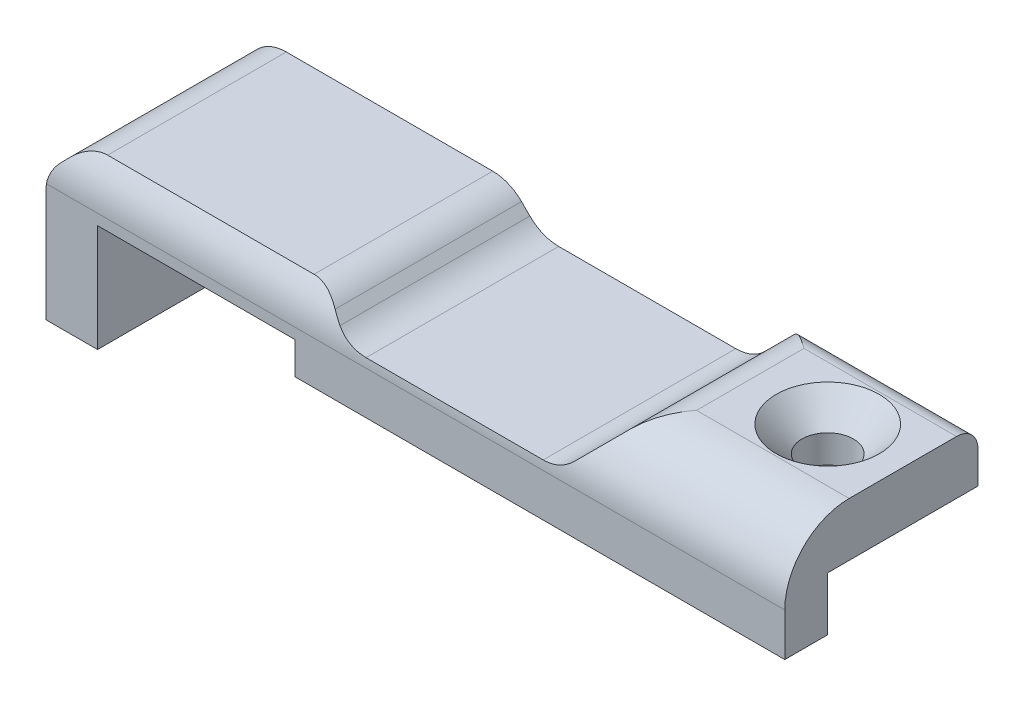
ISO-10303-21;
HEADER;
FILE_DESCRIPTION(('STEP AP214'),'2;1');
FILE_NAME('part.step','',(''),(''),'','','');
FILE_SCHEMA(('AUTOMOTIVE_DESIGN { 1 0 10303 214 1 1 1 1 }'));
ENDSEC;
DATA;
#1=APPLICATION_CONTEXT('core data for automotive mechanical design processes');
#2=APPLICATION_PROTOCOL_DEFINITION('international standard','automotive_design',2000,#1);
#3=PRODUCT_CONTEXT('',#1,'mechanical');
#4=PRODUCT('Part','Part','',(#3));
#5=PRODUCT_RELATED_PRODUCT_CATEGORY('part','',(#4));
#6=PRODUCT_DEFINITION_FORMATION('','',#4);
#7=PRODUCT_DEFINITION_CONTEXT('part definition',#1,'design');
#8=PRODUCT_DEFINITION('design','',#6,#7);
#9=PRODUCT_DEFINITION_SHAPE('','',#8);
#10=(LENGTH_UNIT() NAMED_UNIT(*) SI_UNIT(.MILLI.,.METRE.));
#11=(NAMED_UNIT(*) PLANE_ANGLE_UNIT() SI_UNIT($,.RADIAN.));
#12=(NAMED_UNIT(*) SI_UNIT($,.STERADIAN.) SOLID_ANGLE_UNIT());
#13=UNCERTAINTY_MEASURE_WITH_UNIT(LENGTH_MEASURE(1.E-05),#10,'distance_accuracy_value','');
#14=(GEOMETRIC_REPRESENTATION_CONTEXT(3) GLOBAL_UNCERTAINTY_ASSIGNED_CONTEXT((#13)) GLOBAL_UNIT_ASSIGNED_CONTEXT((#10,
#11,#12)) REPRESENTATION_CONTEXT('',''));
#15=CARTESIAN_POINT('',(0.,0.,0.));
#16=DIRECTION('',(0.,0.,1.));
#17=DIRECTION('',(1.,0.,0.));
#18=AXIS2_PLACEMENT_3D('',#15,#16,#17);
#19=CARTESIAN_POINT('',(8.89,6.35000000000001,11.43));
#20=DIRECTION('',(-1.,0.,0.));
#21=DIRECTION('',(0.,0.,1.));
#22=AXIS2_PLACEMENT_3D('',#19,#20,#21);
#23=PLANE('',#22);
#24=CARTESIAN_POINT('',(8.89,2.54000000000001,7.62));
#25=DIRECTION('',(1.,0.,0.));
#26=DIRECTION('',(0.,0.,-1.));
#27=AXIS2_PLACEMENT_3D('',#24,#25,#26);
#28=CIRCLE('',#27,3.81);
#29=CARTESIAN_POINT('',(8.89,6.35000000000001,7.62));
#30=VERTEX_POINT('',#29);
#31=CARTESIAN_POINT('',(8.89,2.54000000000001,11.43));
#32=VERTEX_POINT('',#31);
#33=EDGE_CURVE('E78',#30,#32,#28,.T.);
#34=ORIENTED_EDGE('',*,*,#33,.T.);
#35=DIRECTION('',(0.,1.,0.));
#36=VECTOR('',#35,1.);
#37=CARTESIAN_POINT('',(8.89,6.35000000000001,11.43));
#38=LINE('',#37,#36);
#39=CARTESIAN_POINT('',(8.89,0.,11.43));
#40=VERTEX_POINT('',#39);
#41=EDGE_CURVE('E97',#40,#32,#38,.T.);
#42=ORIENTED_EDGE('',*,*,#41,.F.);
#43=DIRECTION('',(0.,0.,1.));
#44=VECTOR('',#43,1.);
#45=CARTESIAN_POINT('',(8.89,0.,8.89));
#46=LINE('',#45,#44);
#47=CARTESIAN_POINT('',(8.89,0.,8.89));
#48=VERTEX_POINT('',#47);
#49=EDGE_CURVE('E146',#48,#40,#46,.T.);
#50=ORIENTED_EDGE('',*,*,#49,.F.);
#51=DIRECTION('',(0.,1.,0.));
#52=VECTOR('',#51,1.);
#53=CARTESIAN_POINT('',(8.89,0.,8.89));
#54=LINE('',#53,#52);
#55=CARTESIAN_POINT('',(8.89,3.175,8.89));
#56=VERTEX_POINT('',#55);
#57=EDGE_CURVE('E805',#48,#56,#54,.T.);
#58=ORIENTED_EDGE('',*,*,#57,.T.);
#59=DIRECTION('',(0.,0.,-1.));
#60=VECTOR('',#59,1.);
#61=CARTESIAN_POINT('',(8.89,3.175,11.43));
#62=LINE('',#61,#60);
#63=CARTESIAN_POINT('',(8.89,3.175,0.));
#64=VERTEX_POINT('',#63);
#65=EDGE_CURVE('E286',#56,#64,#62,.T.);
#66=ORIENTED_EDGE('',*,*,#65,.T.);
#67=DIRECTION('',(0.,1.,0.));
#68=VECTOR('',#67,1.);
#69=CARTESIAN_POINT('',(8.89,6.35000000000001,0.));
#70=LINE('',#69,#68);
#71=CARTESIAN_POINT('',(8.89,5.08000000000001,0.));
#72=VERTEX_POINT('',#71);
#73=EDGE_CURVE('E154',#64,#72,#70,.T.);
#74=ORIENTED_EDGE('',*,*,#73,.T.);
#75=CARTESIAN_POINT('',(8.89,5.08000000000001,1.27));
#76=DIRECTION('',(1.,0.,0.));
#77=DIRECTION('',(0.,0.,-1.));
#78=AXIS2_PLACEMENT_3D('',#75,#76,#77);
#79=CIRCLE('',#78,1.27);
#80=CARTESIAN_POINT('',(8.89,6.35000000000001,1.27));
#81=VERTEX_POINT('',#80);
#82=EDGE_CURVE('E301',#72,#81,#79,.T.);
#83=ORIENTED_EDGE('',*,*,#82,.T.);
#84=DIRECTION('',(0.,0.,-1.));
#85=VECTOR('',#84,1.);
#86=CARTESIAN_POINT('',(8.89,6.35000000000001,11.43));
#87=LINE('',#86,#85);
#88=EDGE_CURVE('E101',#30,#81,#87,.T.);
#89=ORIENTED_EDGE('',*,*,#88,.F.);
#90=EDGE_LOOP('',(#34,#42,#50,#58,#66,#74,#83,#89));
#91=FACE_BOUND('',#90,.T.);
#92=ADVANCED_FACE('F43',(#91),#23,.F.);
#93=CARTESIAN_POINT('',(-0.136459548867739,6.35000000000001,11.43));
#94=DIRECTION('',(0.,-1.,0.));
#95=DIRECTION('',(0.,0.,-1.));
#96=AXIS2_PLACEMENT_3D('',#93,#94,#95);
#97=PLANE('',#96);
#98=CARTESIAN_POINT('',(4.445,6.35000000000001,4.445));
#99=DIRECTION('',(0.,-1.,0.));
#100=DIRECTION('',(0.,0.,-1.));
#101=AXIS2_PLACEMENT_3D('',#98,#99,#100);
#102=CIRCLE('',#101,3.04800000000001);
#103=CARTESIAN_POINT('',(4.445,6.35000000000001,1.39699999999999));
#104=VERTEX_POINT('',#103);
#105=EDGE_CURVE('E11',#104,#104,#102,.T.);
#106=ORIENTED_EDGE('',*,*,#105,.T.);
#107=EDGE_LOOP('',(#106));
#108=FACE_BOUND('',#107,.T.);
#109=DIRECTION('',(0.,0.,-1.));
#110=VECTOR('',#109,1.);
#111=CARTESIAN_POINT('',(-0.136459548867739,6.35000000000001,11.43));
#112=LINE('',#111,#110);
#113=CARTESIAN_POINT('',(-0.136459548867736,6.35000000000001,7.62));
#114=VERTEX_POINT('',#113);
#115=CARTESIAN_POINT('',(-0.136459548867736,6.35000000000001,1.27000000000001));
#116=VERTEX_POINT('',#115);
#117=EDGE_CURVE('E280',#114,#116,#112,.T.);
#118=ORIENTED_EDGE('',*,*,#117,.F.);
#119=DIRECTION('',(1.,0.,0.));
#120=VECTOR('',#119,1.);
#121=CARTESIAN_POINT('',(-34.811,6.35000000000001,7.62));
#122=LINE('',#121,#120);
#123=EDGE_CURVE('E466',#114,#30,#122,.T.);
#124=ORIENTED_EDGE('',*,*,#123,.T.);
#125=ORIENTED_EDGE('',*,*,#88,.T.);
#126=DIRECTION('',(1.,0.,0.));
#127=VECTOR('',#126,1.);
#128=CARTESIAN_POINT('',(-34.811,6.35000000000001,1.27000000000001));
#129=LINE('',#128,#127);
#130=EDGE_CURVE('E825',#116,#81,#129,.T.);
#131=ORIENTED_EDGE('',*,*,#130,.F.);
#132=EDGE_LOOP('',(#118,#124,#125,#131));
#133=FACE_BOUND('',#132,.T.);
#134=ADVANCED_FACE('F320',(#108,#133),#97,.F.);
#135=CARTESIAN_POINT('',(-0.136459548867738,3.93804761601321,11.43));
#136=DIRECTION('',(0.,0.,-1.));
#137=DIRECTION('',(-1.,0.,0.));
#138=AXIS2_PLACEMENT_3D('',#135,#136,#137);
#139=CYLINDRICAL_SURFACE('',#138,2.41195238398679);
#140=CARTESIAN_POINT('',(-1.84196743548386,5.64355550262933,9.82998715880868));
#141=CARTESIAN_POINT('',(-1.77178366951944,5.71368311626515,9.73146145869284));
#142=CARTESIAN_POINT('',(-1.69873983576753,5.77813009525034,9.63107517977327));
#143=CARTESIAN_POINT('',(-1.54815919707865,5.8960568252785,9.42744531922986));
#144=CARTESIAN_POINT('',(-1.47062696165406,5.94954748727323,9.32420469760049));
#145=CARTESIAN_POINT('',(-1.31239286579057,6.04594717733401,9.11584744789578));
#146=CARTESIAN_POINT('',(-1.23170137519379,6.08888792896851,9.01073748913356));
#147=CARTESIAN_POINT('',(-1.06778836966117,6.16477153712431,8.79889475452119));
#148=CARTESIAN_POINT('',(-0.984566509339983,6.19771302198445,8.6921617581358));
#149=CARTESIAN_POINT('',(-0.776866440757038,6.26707707969138,8.42719771553398));
#150=CARTESIAN_POINT('',(-0.651348175336397,6.29788375457997,8.26829594431328));
#151=CARTESIAN_POINT('',(-0.398578981119298,6.33912690639315,7.94945142902917));
#152=CARTESIAN_POINT('',(-0.271329806075347,6.34958264992058,7.78950981351292));
#153=CARTESIAN_POINT('',(-0.141583673153802,6.34999591376595,7.62644017696876));
#154=CARTESIAN_POINT('',(-0.139021593746653,6.34999999580659,7.62322006698298));
#155=CARTESIAN_POINT('',(-0.136459548867738,6.35000000000001,7.62));
#156=B_SPLINE_CURVE_WITH_KNOTS('',3,(#140,#141,#142,#143,#144,#145,#146,#147,#148,#149,#150,
#151,#152,#153,#154,#155),.UNSPECIFIED.,.F.,.F.,(4,2,2,2,2,2,2,4),(0.,0.419168530163067,
0.837917575792197,1.25539159345996,1.67292285276372,2.28631717536481,2.89913050322339,
2.91147554878794),.UNSPECIFIED.);
#157=CARTESIAN_POINT('',(-1.84196743548386,5.64355550262933,9.82998715880867));
#158=VERTEX_POINT('',#157);
#159=EDGE_CURVE('E104',#114,#158,#156,.F.);
#160=ORIENTED_EDGE('',*,*,#159,.F.);
#161=ORIENTED_EDGE('',*,*,#117,.T.);
#162=CARTESIAN_POINT('',(-1.84196743548386,5.64355550262933,0.131885245040638));
#163=CARTESIAN_POINT('',(-1.79793693205518,5.68758297812281,0.153704066183343));
#164=CARTESIAN_POINT('',(-1.75275278971515,5.729360971172,0.177553362694673));
#165=CARTESIAN_POINT('',(-1.66054925654517,5.80843498003241,0.228605431546575));
#166=CARTESIAN_POINT('',(-1.61353319376124,5.84573866345702,0.255802300230631));
#167=CARTESIAN_POINT('',(-1.51820448900534,5.91586986545733,0.312789527934201));
#168=CARTESIAN_POINT('',(-1.46989890524847,5.94871742140326,0.342567218612712));
#169=CARTESIAN_POINT('',(-1.3720583492689,6.01028120903042,0.404333808388132));
#170=CARTESIAN_POINT('',(-1.32252265042037,6.03899492736071,0.436324035345448));
#171=CARTESIAN_POINT('',(-1.13485849254975,6.13920039649939,0.559649719670815));
#172=CARTESIAN_POINT('',(-0.993423147173285,6.19759931126629,0.656852275061647));
#173=CARTESIAN_POINT('',(-0.706817468365892,6.28640332252148,0.858154163345799));
#174=CARTESIAN_POINT('',(-0.561642126691629,6.31676863660746,0.962263073307873));
#175=CARTESIAN_POINT('',(-0.325524014984579,6.34429295190112,1.13281795108483));
#176=CARTESIAN_POINT('',(-0.23495233796047,6.34968851192263,1.19853057465999));
#177=CARTESIAN_POINT('',(-0.141759432926304,6.3499956315524,1.26615422440971));
#178=CARTESIAN_POINT('',(-0.13910947532084,6.34999999841032,1.26807712317475));
#179=CARTESIAN_POINT('',(-0.136459548867738,6.35000000000001,1.27));
#180=B_SPLINE_CURVE_WITH_KNOTS('',3,(#162,#163,#164,#165,#166,#167,#168,#169,#170,#171,#172,
#173,#174,#175,#176,#177,#178,#179),.UNSPECIFIED.,.F.,.F.,(4,2,2,2,2,2,2,2,4),(0.,
0.197768863282341,0.395193815783404,0.591699317258445,0.788323792977692,1.32910455622659,
1.87065156555033,2.20625492068683,2.21607725579665),.UNSPECIFIED.);
#181=CARTESIAN_POINT('',(-1.84196743548386,5.64355550262933,0.131885245040637));
#182=VERTEX_POINT('',#181);
#183=EDGE_CURVE('E303',#182,#116,#180,.T.);
#184=ORIENTED_EDGE('',*,*,#183,.F.);
#185=DIRECTION('',(0.,0.,-1.));
#186=VECTOR('',#185,1.);
#187=CARTESIAN_POINT('',(-1.84196743548386,5.64355550262933,11.43));
#188=LINE('',#187,#186);
#189=EDGE_CURVE('E276',#158,#182,#188,.T.);
#190=ORIENTED_EDGE('',*,*,#189,.F.);
#191=EDGE_LOOP('',(#160,#161,#184,#190));
#192=FACE_BOUND('',#191,.T.);
#193=ADVANCED_FACE('F325',(#192),#139,.T.);
#194=CARTESIAN_POINT('',(-1.84196743548386,5.64355550262933,11.43));
#195=DIRECTION('',(0.707106781186549,-0.707106781186546,0.));
#196=DIRECTION('',(0.707106781186546,0.707106781186549,0.));
#197=AXIS2_PLACEMENT_3D('',#194,#195,#196);
#198=PLANE('',#197);
#199=CARTESIAN_POINT('',(-4.94552293811318,2.54000000000001,7.62));
#200=DIRECTION('',(0.707106781186549,-0.707106781186546,0.));
#201=DIRECTION('',(0.707106781186546,0.707106781186549,0.));
#202=AXIS2_PLACEMENT_3D('',#199,#200,#201);
#203=ELLIPSE('',#202,5.38815367264148,3.81);
#204=CARTESIAN_POINT('',(-3.73107844074251,3.75444449737068,11.2312635687258));
#205=VERTEX_POINT('',#204);
#206=EDGE_CURVE('E475',#158,#205,#203,.T.);
#207=ORIENTED_EDGE('',*,*,#206,.F.);
#208=ORIENTED_EDGE('',*,*,#189,.T.);
#209=CARTESIAN_POINT('',(-2.40552293811318,5.08000000000001,1.27));
#210=DIRECTION('',(0.707106781186549,-0.707106781186546,0.));
#211=DIRECTION('',(0.707106781186546,0.707106781186549,0.));
#212=AXIS2_PLACEMENT_3D('',#209,#210,#211);
#213=ELLIPSE('',#212,1.79605122421383,1.27);
#214=CARTESIAN_POINT('',(-2.40552293811318,5.08,0.));
#215=VERTEX_POINT('',#214);
#216=EDGE_CURVE('E456',#215,#182,#213,.T.);
#217=ORIENTED_EDGE('',*,*,#216,.F.);
#218=DIRECTION('',(-0.707106781186546,-0.707106781186549,0.));
#219=VECTOR('',#218,1.);
#220=CARTESIAN_POINT('',(-1.84196743548386,5.64355550262933,0.));
#221=LINE('',#220,#219);
#222=CARTESIAN_POINT('',(-3.73107844074251,3.75444449737067,0.));
#223=VERTEX_POINT('',#222);
#224=EDGE_CURVE('E158',#215,#223,#221,.T.);
#225=ORIENTED_EDGE('',*,*,#224,.T.);
#226=DIRECTION('',(0.,0.,-1.));
#227=VECTOR('',#226,1.);
#228=CARTESIAN_POINT('',(-3.73107844074251,3.75444449737067,11.43));
#229=LINE('',#228,#227);
#230=EDGE_CURVE('E272',#205,#223,#229,.T.);
#231=ORIENTED_EDGE('',*,*,#230,.F.);
#232=EDGE_LOOP('',(#207,#208,#217,#225,#231));
#233=FACE_BOUND('',#232,.T.);
#234=ADVANCED_FACE('F461',(#233),#198,.F.);
#235=CARTESIAN_POINT('',(-5.43658632735864,5.45995238398679,11.43));
#236=DIRECTION('',(0.,0.,-1.));
#237=DIRECTION('',(-1.,0.,0.));
#238=AXIS2_PLACEMENT_3D('',#235,#236,#237);
#239=CYLINDRICAL_SURFACE('',#238,2.41195238398679);
#240=CARTESIAN_POINT('',(-3.73107844074251,3.75444449737068,11.2312635687258));
#241=CARTESIAN_POINT('',(-3.77559546602806,3.70990773074528,11.2462412721785));
#242=CARTESIAN_POINT('',(-3.82210836548497,3.66690166186912,11.2597865471746));
#243=CARTESIAN_POINT('',(-3.91875064828693,3.58439731121499,11.284312355944));
#244=CARTESIAN_POINT('',(-3.96887873298133,3.54489778107771,11.2952938047503));
#245=CARTESIAN_POINT('',(-4.07233344419094,3.46987484278015,11.3149880684811));
#246=CARTESIAN_POINT('',(-4.12565533027812,3.43434575558424,11.3237041479285));
#247=CARTESIAN_POINT('',(-4.23515103911099,3.36754093821947,11.3392000153414));
#248=CARTESIAN_POINT('',(-4.29132496625207,3.33626536389948,11.3459797323685));
#249=CARTESIAN_POINT('',(-4.46344433775202,3.24929874167538,11.3638648003863));
#250=CARTESIAN_POINT('',(-4.5831426706713,3.20035506729322,11.3725433699436));
#251=CARTESIAN_POINT('',(-4.82890813267759,3.12224830277758,11.3854574834869));
#252=CARTESIAN_POINT('',(-4.95496908147711,3.09306639989072,11.3896972552124));
#253=CARTESIAN_POINT('',(-5.14111383417009,3.06543018384033,11.3936036677396));
#254=CARTESIAN_POINT('',(-5.20006545301393,3.05889242040026,11.3945034817658));
#255=CARTESIAN_POINT('',(-5.31819923464802,3.05018107167554,11.3956890832861));
#256=CARTESIAN_POINT('',(-5.37738086039983,3.04800034272682,11.395975875926));
#257=CARTESIAN_POINT('',(-5.43658632735864,3.048,11.3959814618189));
#258=B_SPLINE_CURVE_WITH_KNOTS('',3,(#240,#241,#242,#243,#244,#245,#246,#247,#248,#249,#250,
#251,#252,#253,#254,#255,#256,#257),.UNSPECIFIED.,.F.,.F.,(4,2,2,2,2,2,2,2,4),(0.,
0.194100099105337,0.388130817369291,0.581880356575705,0.77563699286115,1.16257613496534,
1.54914640009441,1.72696612931631,1.90449407056569),.UNSPECIFIED.);
#259=CARTESIAN_POINT('',(-5.43658632735864,3.048,11.3959814618189));
#260=VERTEX_POINT('',#259);
#261=EDGE_CURVE('E474',#205,#260,#258,.T.);
#262=ORIENTED_EDGE('',*,*,#261,.F.);
#263=ORIENTED_EDGE('',*,*,#230,.T.);
#264=CARTESIAN_POINT('',(-5.43658632735864,5.45995238398679,0.));
#265=DIRECTION('',(0.,0.,-1.));
#266=DIRECTION('',(-1.,0.,0.));
#267=AXIS2_PLACEMENT_3D('',#264,#265,#266);
#268=CIRCLE('',#267,2.41195238398679);
#269=CARTESIAN_POINT('',(-5.43658632735864,3.048,0.));
#270=VERTEX_POINT('',#269);
#271=EDGE_CURVE('E162',#223,#270,#268,.T.);
#272=ORIENTED_EDGE('',*,*,#271,.T.);
#273=DIRECTION('',(0.,0.,-1.));
#274=VECTOR('',#273,1.);
#275=CARTESIAN_POINT('',(-5.43658632735864,3.048,11.43));
#276=LINE('',#275,#274);
#277=EDGE_CURVE('E268',#260,#270,#276,.T.);
#278=ORIENTED_EDGE('',*,*,#277,.F.);
#279=EDGE_LOOP('',(#262,#263,#272,#278));
#280=FACE_BOUND('',#279,.T.);
#281=ADVANCED_FACE('F473',(#280),#239,.F.);
#282=CARTESIAN_POINT('',(-5.43658632735864,3.048,11.43));
#283=DIRECTION('',(0.,-1.,0.));
#284=DIRECTION('',(1.,0.,0.));
#285=AXIS2_PLACEMENT_3D('',#282,#283,#284);
#286=PLANE('',#285);
#287=DIRECTION('',(1.,0.,0.));
#288=VECTOR('',#287,1.);
#289=CARTESIAN_POINT('',(-34.811,3.048,11.3959814618189));
#290=LINE('',#289,#288);
#291=CARTESIAN_POINT('',(-15.914026628397,3.048,11.3959814618189));
#292=VERTEX_POINT('',#291);
#293=EDGE_CURVE('E584',#260,#292,#290,.F.);
#294=ORIENTED_EDGE('',*,*,#293,.F.);
#295=ORIENTED_EDGE('',*,*,#277,.T.);
#296=DIRECTION('',(-1.,0.,0.));
#297=VECTOR('',#296,1.);
#298=CARTESIAN_POINT('',(-5.43658632735864,3.048,0.));
#299=LINE('',#298,#297);
#300=CARTESIAN_POINT('',(-15.914026628397,3.048,0.));
#301=VERTEX_POINT('',#300);
#302=EDGE_CURVE('E166',#270,#301,#299,.T.);
#303=ORIENTED_EDGE('',*,*,#302,.T.);
#304=DIRECTION('',(0.,0.,-1.));
#305=VECTOR('',#304,1.);
#306=CARTESIAN_POINT('',(-15.914026628397,3.048,11.43));
#307=LINE('',#306,#305);
#308=EDGE_CURVE('E264',#292,#301,#307,.T.);
#309=ORIENTED_EDGE('',*,*,#308,.F.);
#310=EDGE_LOOP('',(#294,#295,#303,#309));
#311=FACE_BOUND('',#310,.T.);
#312=ADVANCED_FACE('F574',(#311),#286,.F.);
#313=CARTESIAN_POINT('',(-15.914026628397,5.45995238398679,11.43));
#314=DIRECTION('',(0.,0.,-1.));
#315=DIRECTION('',(-1.,0.,0.));
#316=AXIS2_PLACEMENT_3D('',#313,#314,#315);
#317=CYLINDRICAL_SURFACE('',#316,2.41195238398679);
#318=CARTESIAN_POINT('',(-15.914026628397,3.048,11.3959814618189));
#319=CARTESIAN_POINT('',(-15.9804756539234,3.04799268435383,11.3959694888572));
#320=CARTESIAN_POINT('',(-16.0469244260594,3.05074569876824,11.3956116517088));
#321=CARTESIAN_POINT('',(-16.1793639677936,3.06172045961379,11.3941177237721));
#322=CARTESIAN_POINT('',(-16.2453547101426,3.06994252864226,11.3929815870749));
#323=CARTESIAN_POINT('',(-16.376540770092,3.09182481371227,11.3898414513722));
#324=CARTESIAN_POINT('',(-16.4417342818171,3.10549562272949,11.3878357611844));
#325=CARTESIAN_POINT('',(-16.5707271500331,3.13816765389063,11.3827875715614));
#326=CARTESIAN_POINT('',(-16.6345265916848,3.15716854944383,11.3797451356485));
#327=CARTESIAN_POINT('',(-16.7603671419901,3.20038286305868,11.3723958632265));
#328=CARTESIAN_POINT('',(-16.82240551489,3.22460393728187,11.3680871661475));
#329=CARTESIAN_POINT('',(-16.9441631173848,3.27803749809088,11.3579325604968));
#330=CARTESIAN_POINT('',(-17.0038824339613,3.30724979724677,11.3520867096437));
#331=CARTESIAN_POINT('',(-17.1204054884783,3.37032499803628,11.3385612341551));
#332=CARTESIAN_POINT('',(-17.1772159999576,3.40417635074724,11.3308861294294));
#333=CARTESIAN_POINT('',(-17.2876132895685,3.47623966669994,11.3133627971321));
#334=CARTESIAN_POINT('',(-17.3412016926863,3.5144494032526,11.3035156768588));
#335=CARTESIAN_POINT('',(-17.4330306061094,3.58572937933976,11.2838217456669));
#336=CARTESIAN_POINT('',(-17.4719994565921,3.61800517150343,11.2744794201936));
#337=CARTESIAN_POINT('',(-17.5475736130158,3.68468264306864,11.2541458876862));
#338=CARTESIAN_POINT('',(-17.5841803744876,3.71908298722983,11.2431557102169));
#339=CARTESIAN_POINT('',(-17.6195345150131,3.75444449737065,11.2312635687258));
#340=B_SPLINE_CURVE_WITH_KNOTS('',3,(#318,#319,#320,#321,#322,#323,#324,#325,#326,#327,#328,
#329,#330,#331,#332,#333,#334,#335,#336,#337,#338,#339),.UNSPECIFIED.,.F.,.F.,(4,2,2,2,2,2,2,2,
2,2,4),(0.,0.199288876653171,0.398589509590763,0.59827951068279,0.79795727882863,
0.997929921347005,1.19789505616411,1.39737112739369,1.5967457393702,1.75098989825153,
1.90513808511517),.UNSPECIFIED.);
#341=CARTESIAN_POINT('',(-17.6195345150131,3.75444449737065,11.2312635687258));
#342=VERTEX_POINT('',#341);
#343=EDGE_CURVE('E577',#292,#342,#340,.T.);
#344=ORIENTED_EDGE('',*,*,#343,.F.);
#345=ORIENTED_EDGE('',*,*,#308,.T.);
#346=CARTESIAN_POINT('',(-15.914026628397,5.45995238398679,0.));
#347=DIRECTION('',(0.,0.,-1.));
#348=DIRECTION('',(-1.,0.,0.));
#349=AXIS2_PLACEMENT_3D('',#346,#347,#348);
#350=CIRCLE('',#349,2.41195238398679);
#351=CARTESIAN_POINT('',(-17.6195345150131,3.75444449737065,0.));
#352=VERTEX_POINT('',#351);
#353=EDGE_CURVE('E170',#301,#352,#350,.T.);
#354=ORIENTED_EDGE('',*,*,#353,.T.);
#355=DIRECTION('',(0.,0.,-1.));
#356=VECTOR('',#355,1.);
#357=CARTESIAN_POINT('',(-17.6195345150131,3.75444449737065,11.43));
#358=LINE('',#357,#356);
#359=EDGE_CURVE('E260',#342,#352,#358,.T.);
#360=ORIENTED_EDGE('',*,*,#359,.F.);
#361=EDGE_LOOP('',(#344,#345,#354,#360));
#362=FACE_BOUND('',#361,.T.);
#363=ADVANCED_FACE('F569',(#362),#317,.F.);
#364=CARTESIAN_POINT('',(-17.6195345150131,3.75444449737065,11.43));
#365=DIRECTION('',(-0.707106781186539,-0.707106781186556,0.));
#366=DIRECTION('',(0.707106781186556,-0.707106781186539,0.));
#367=AXIS2_PLACEMENT_3D('',#364,#365,#366);
#368=PLANE('',#367);
#369=CARTESIAN_POINT('',(-16.4050900176424,2.54000000000001,7.62));
#370=DIRECTION('',(-0.707106781186539,-0.707106781186556,0.));
#371=DIRECTION('',(0.707106781186556,-0.707106781186539,0.));
#372=AXIS2_PLACEMENT_3D('',#369,#370,#371);
#373=ELLIPSE('',#372,5.38815367264155,3.81);
#374=CARTESIAN_POINT('',(-18.1116455202718,4.24655550262933,11.0264304361671));
#375=VERTEX_POINT('',#374);
#376=EDGE_CURVE('E559',#342,#375,#373,.T.);
#377=ORIENTED_EDGE('',*,*,#376,.F.);
#378=ORIENTED_EDGE('',*,*,#359,.T.);
#379=DIRECTION('',(-0.707106781186556,0.707106781186539,0.));
#380=VECTOR('',#379,1.);
#381=CARTESIAN_POINT('',(-17.6195345150131,3.75444449737065,0.));
#382=LINE('',#381,#380);
#383=CARTESIAN_POINT('',(-18.1116455202718,4.24655550262933,0.));
#384=VERTEX_POINT('',#383);
#385=EDGE_CURVE('E174',#352,#384,#382,.T.);
#386=ORIENTED_EDGE('',*,*,#385,.T.);
#387=DIRECTION('',(0.,0.,-1.));
#388=VECTOR('',#387,1.);
#389=CARTESIAN_POINT('',(-18.1116455202718,4.24655550262933,11.43));
#390=LINE('',#389,#388);
#391=EDGE_CURVE('E256',#375,#384,#390,.T.);
#392=ORIENTED_EDGE('',*,*,#391,.F.);
#393=EDGE_LOOP('',(#377,#378,#386,#392));
#394=FACE_BOUND('',#393,.T.);
#395=ADVANCED_FACE('F565',(#394),#368,.F.);
#396=CARTESIAN_POINT('',(-19.8171534068879,2.5410476160132,11.43));
#397=DIRECTION('',(0.,0.,-1.));
#398=DIRECTION('',(-1.,0.,0.));
#399=AXIS2_PLACEMENT_3D('',#396,#397,#398);
#400=CYLINDRICAL_SURFACE('',#399,2.41195238398679);
#401=CARTESIAN_POINT('',(-18.1116455202718,4.24655550262933,11.0264304361671));
#402=CARTESIAN_POINT('',(-18.1590656720571,4.2939591417386,11.0026839095847));
#403=CARTESIAN_POINT('',(-18.2083620037865,4.33931654810651,10.9787200437792));
#404=CARTESIAN_POINT('',(-18.3106345653221,4.42583438770904,10.930917321667));
#405=CARTESIAN_POINT('',(-18.3636134436017,4.46699174666681,10.9070785688743));
#406=CARTESIAN_POINT('',(-18.5287595953788,4.58454989562613,10.8362567347794));
#407=CARTESIAN_POINT('',(-18.6463512516706,4.65424985842372,10.7903788518573));
#408=CARTESIAN_POINT('',(-18.874054069552,4.7639687788211,10.714155321173));
#409=CARTESIAN_POINT('',(-18.9822997610754,4.80696481350171,10.6824976656211));
#410=CARTESIAN_POINT('',(-19.2056754984945,4.87710645626516,10.6293165189469));
#411=CARTESIAN_POINT('',(-19.3207612736921,4.90434386888856,10.6077344758491));
#412=CARTESIAN_POINT('',(-19.5002210691291,4.93292043190686,10.5848253730116));
#413=CARTESIAN_POINT('',(-19.5630700295501,4.9404146648634,10.5787459351203));
#414=CARTESIAN_POINT('',(-19.6896461713212,4.95046897368797,10.570551690328));
#415=CARTESIAN_POINT('',(-19.753375718739,4.95301096539699,10.5684514149473));
#416=CARTESIAN_POINT('',(-19.8171534068879,4.953,10.568479438626));
#417=B_SPLINE_CURVE_WITH_KNOTS('',3,(#401,#402,#403,#404,#405,#406,#407,#408,#409,#410,#411,
#412,#413,#414,#415,#416),.UNSPECIFIED.,.F.,.F.,(4,2,2,2,2,2,2,4),(0.,0.21325830180271,
0.426671597601292,0.857015180991659,1.21776643210783,1.57639433598978,1.76686027806684,
1.95802045276746),.UNSPECIFIED.);
#418=CARTESIAN_POINT('',(-19.8171534068879,4.95299999999999,10.568479438626));
#419=VERTEX_POINT('',#418);
#420=EDGE_CURVE('E552',#375,#419,#417,.T.);
#421=ORIENTED_EDGE('',*,*,#420,.F.);
#422=ORIENTED_EDGE('',*,*,#391,.T.);
#423=CARTESIAN_POINT('',(-19.8171534068879,2.5410476160132,0.));
#424=DIRECTION('',(0.,0.,1.));
#425=DIRECTION('',(1.,0.,0.));
#426=AXIS2_PLACEMENT_3D('',#423,#424,#425);
#427=CIRCLE('',#426,2.41195238398679);
#428=CARTESIAN_POINT('',(-19.8171534068879,4.95299999999999,0.));
#429=VERTEX_POINT('',#428);
#430=EDGE_CURVE('E178',#384,#429,#427,.T.);
#431=ORIENTED_EDGE('',*,*,#430,.T.);
#432=DIRECTION('',(0.,0.,-1.));
#433=VECTOR('',#432,1.);
#434=CARTESIAN_POINT('',(-19.8171534068879,4.95299999999999,11.43));
#435=LINE('',#434,#433);
#436=EDGE_CURVE('E252',#419,#429,#435,.T.);
#437=ORIENTED_EDGE('',*,*,#436,.F.);
#438=EDGE_LOOP('',(#421,#422,#431,#437));
#439=FACE_BOUND('',#438,.T.);
#440=ADVANCED_FACE('F561',(#439),#400,.T.);
#441=CARTESIAN_POINT('',(-32.0264595488677,4.95299999999999,11.43));
#442=DIRECTION('',(0.,-1.,0.));
#443=DIRECTION('',(1.,0.,0.));
#444=AXIS2_PLACEMENT_3D('',#441,#442,#443);
#445=PLANE('',#444);
#446=DIRECTION('',(1.,0.,0.));
#447=VECTOR('',#446,1.);
#448=CARTESIAN_POINT('',(-34.811,4.95299999999999,10.568479438626));
#449=LINE('',#448,#447);
#450=CARTESIAN_POINT('',(-32.0264595488677,4.95299999999999,10.568479438626));
#451=VERTEX_POINT('',#450);
#452=EDGE_CURVE('E548',#419,#451,#449,.F.);
#453=ORIENTED_EDGE('',*,*,#452,.F.);
#454=ORIENTED_EDGE('',*,*,#436,.T.);
#455=DIRECTION('',(-1.,0.,0.));
#456=VECTOR('',#455,1.);
#457=CARTESIAN_POINT('',(-32.0264595488677,4.95299999999999,0.));
#458=LINE('',#457,#456);
#459=CARTESIAN_POINT('',(-32.0264595488677,4.95299999999999,0.));
#460=VERTEX_POINT('',#459);
#461=EDGE_CURVE('E182',#429,#460,#458,.T.);
#462=ORIENTED_EDGE('',*,*,#461,.T.);
#463=DIRECTION('',(0.,0.,-1.));
#464=VECTOR('',#463,1.);
#465=CARTESIAN_POINT('',(-32.0264595488677,4.95299999999999,11.43));
#466=LINE('',#465,#464);
#467=EDGE_CURVE('E248',#451,#460,#466,.T.);
#468=ORIENTED_EDGE('',*,*,#467,.F.);
#469=EDGE_LOOP('',(#453,#454,#462,#468));
#470=FACE_BOUND('',#469,.T.);
#471=ADVANCED_FACE('F537',(#470),#445,.F.);
#472=CARTESIAN_POINT('',(-32.0264595488678,2.5410476160132,11.43));
#473=DIRECTION('',(0.,0.,-1.));
#474=DIRECTION('',(-1.,0.,0.));
#475=AXIS2_PLACEMENT_3D('',#472,#473,#474);
#476=CYLINDRICAL_SURFACE('',#475,2.41195238398679);
#477=CARTESIAN_POINT('',(-32.0264595488677,4.95299999999999,10.568479438626));
#478=CARTESIAN_POINT('',(-32.086642637764,4.95301453614982,10.5684504339567));
#479=CARTESIAN_POINT('',(-32.1468083231622,4.95074810513409,10.5703221135668));
#480=CARTESIAN_POINT('',(-32.2665218443152,4.94176926206025,10.5776450944113));
#481=CARTESIAN_POINT('',(-32.3260702999379,4.93506186321999,10.5830923592613));
#482=CARTESIAN_POINT('',(-32.4435567030108,4.91739888928308,10.597279559071));
#483=CARTESIAN_POINT('',(-32.5015044669419,4.90648330782177,10.6059884744301));
#484=CARTESIAN_POINT('',(-32.6159559831709,4.88058896146327,10.6263291627955));
#485=CARTESIAN_POINT('',(-32.672459405587,4.8656092772559,10.6379615970651));
#486=CARTESIAN_POINT('',(-32.8387919700871,4.81503165726577,10.6764889172211));
#487=CARTESIAN_POINT('',(-32.9460681270276,4.77369806110722,10.7070971330189));
#488=CARTESIAN_POINT('',(-33.1523098633938,4.67716764331349,10.7746921084205));
#489=CARTESIAN_POINT('',(-33.251248146637,4.6219274818019,10.8116986934917));
#490=CARTESIAN_POINT('',(-33.4154700511806,4.51466434562565,10.878790248429));
#491=CARTESIAN_POINT('',(-33.4828801741984,4.46544546060072,10.908218303311));
#492=CARTESIAN_POINT('',(-33.6117976868166,4.36067984889574,10.9673634422574));
#493=CARTESIAN_POINT('',(-33.6733340070949,4.30516743577596,10.9970782208541));
#494=CARTESIAN_POINT('',(-33.7319674354839,4.24655550262931,11.0264304361671));
#495=B_SPLINE_CURVE_WITH_KNOTS('',3,(#477,#478,#479,#480,#481,#482,#483,#484,#485,#486,#487,
#488,#489,#490,#491,#492,#493,#494),.UNSPECIFIED.,.F.,.F.,(4,2,2,2,2,2,2,2,4),(0.,
0.180449429368815,0.360695503640781,0.539269185808922,0.717883295516511,1.07322295009942,
1.429684036604,1.6947849200479,1.95850425962155),.UNSPECIFIED.);
#496=CARTESIAN_POINT('',(-33.7319674354839,4.24655550262931,11.0264304361671));
#497=VERTEX_POINT('',#496);
#498=EDGE_CURVE('E541',#451,#497,#495,.T.);
#499=ORIENTED_EDGE('',*,*,#498,.F.);
#500=ORIENTED_EDGE('',*,*,#467,.T.);
#501=CARTESIAN_POINT('',(-32.0264595488678,2.5410476160132,0.));
#502=DIRECTION('',(0.,0.,1.));
#503=DIRECTION('',(1.,0.,0.));
#504=AXIS2_PLACEMENT_3D('',#501,#502,#503);
#505=CIRCLE('',#504,2.41195238398679);
#506=CARTESIAN_POINT('',(-33.7319674354839,4.24655550262931,0.));
#507=VERTEX_POINT('',#506);
#508=EDGE_CURVE('E186',#460,#507,#505,.T.);
#509=ORIENTED_EDGE('',*,*,#508,.T.);
#510=DIRECTION('',(0.,0.,-1.));
#511=VECTOR('',#510,1.);
#512=CARTESIAN_POINT('',(-33.7319674354839,4.24655550262931,11.43));
#513=LINE('',#512,#511);
#514=EDGE_CURVE('E244',#497,#507,#513,.T.);
#515=ORIENTED_EDGE('',*,*,#514,.F.);
#516=EDGE_LOOP('',(#499,#500,#509,#515));
#517=FACE_BOUND('',#516,.T.);
#518=ADVANCED_FACE('F532',(#517),#476,.T.);
#519=CARTESIAN_POINT('',(-34.1045555026293,3.87396743548386,11.43));
#520=DIRECTION('',(0.707106781186551,-0.707106781186544,0.));
#521=DIRECTION('',(0.707106781186544,0.707106781186551,0.));
#522=AXIS2_PLACEMENT_3D('',#519,#520,#521);
#523=PLANE('',#522);
#524=CARTESIAN_POINT('',(-35.4385229381132,2.54000000000001,7.62));
#525=DIRECTION('',(0.707106781186551,-0.707106781186544,0.));
#526=DIRECTION('',(0.707106781186544,0.707106781186551,0.));
#527=AXIS2_PLACEMENT_3D('',#524,#525,#526);
#528=ELLIPSE('',#527,5.38815367264146,3.81);
#529=CARTESIAN_POINT('',(-34.1045555026293,3.87396743548386,11.1888416721772));
#530=VERTEX_POINT('',#529);
#531=EDGE_CURVE('E549',#497,#530,#528,.T.);
#532=ORIENTED_EDGE('',*,*,#531,.F.);
#533=ORIENTED_EDGE('',*,*,#514,.T.);
#534=DIRECTION('',(-0.707106781186544,-0.707106781186551,0.));
#535=VECTOR('',#534,1.);
#536=CARTESIAN_POINT('',(-34.1045555026293,3.87396743548386,0.));
#537=LINE('',#536,#535);
#538=CARTESIAN_POINT('',(-34.1045555026293,3.87396743548386,0.));
#539=VERTEX_POINT('',#538);
#540=EDGE_CURVE('E190',#507,#539,#537,.T.);
#541=ORIENTED_EDGE('',*,*,#540,.T.);
#542=DIRECTION('',(0.,0.,-1.));
#543=VECTOR('',#542,1.);
#544=CARTESIAN_POINT('',(-34.1045555026293,3.87396743548386,11.43));
#545=LINE('',#544,#543);
#546=EDGE_CURVE('E240',#530,#539,#545,.T.);
#547=ORIENTED_EDGE('',*,*,#546,.F.);
#548=EDGE_LOOP('',(#532,#533,#541,#547));
#549=FACE_BOUND('',#548,.T.);
#550=ADVANCED_FACE('F345',(#549),#523,.F.);
#551=CARTESIAN_POINT('',(-32.3990476160132,2.16845954886774,11.43));
#552=DIRECTION('',(0.,0.,-1.));
#553=DIRECTION('',(-1.,0.,0.));
#554=AXIS2_PLACEMENT_3D('',#551,#552,#553);
#555=CYLINDRICAL_SURFACE('',#554,2.4119523839868);
#556=CARTESIAN_POINT('',(-34.1045555026293,3.87396743548386,11.1888416721772));
#557=CARTESIAN_POINT('',(-34.1501033582168,3.82840651515453,11.205869353644));
#558=CARTESIAN_POINT('',(-34.1938683803408,3.78100039208205,11.2225947978895));
#559=CARTESIAN_POINT('',(-34.2776369183807,3.68259676922017,11.2550059499648));
#560=CARTESIAN_POINT('',(-34.3176383476465,3.63159730425653,11.2706910796073));
#561=CARTESIAN_POINT('',(-34.4293909720929,3.47654352919155,11.3146238992739));
#562=CARTESIAN_POINT('',(-34.4955956176682,3.36772620496122,11.3408030718167));
#563=CARTESIAN_POINT('',(-34.5806044563348,3.19904245771048,11.3729844637114));
#564=CARTESIAN_POINT('',(-34.6061685407589,3.14310564511744,11.3824042494988));
#565=CARTESIAN_POINT('',(-34.6530552955587,3.0291305335894,11.3989099682983));
#566=CARTESIAN_POINT('',(-34.6743783836557,2.97109244228832,11.4059961312082));
#567=CARTESIAN_POINT('',(-34.713089528305,2.85166596246678,11.4177174944905));
#568=CARTESIAN_POINT('',(-34.7303512095494,2.79022927830674,11.4222788027204));
#569=CARTESIAN_POINT('',(-34.7599933323472,2.66599927103558,11.4284276112038));
#570=CARTESIAN_POINT('',(-34.7723702797115,2.60320501055685,11.4300129857212));
#571=CARTESIAN_POINT('',(-34.7822118981793,2.54000000000001,11.43));
#572=B_SPLINE_CURVE_WITH_KNOTS('',3,(#556,#557,#558,#559,#560,#561,#562,#563,#564,#565,#566,
#567,#568,#569,#570,#571),.UNSPECIFIED.,.F.,.F.,(4,2,2,2,2,2,2,4),(0.,0.19978292723429,
0.399675975404516,0.787680199291306,0.974164916939271,1.16063125747428,1.35229963860842,
1.54410487815169),.UNSPECIFIED.);
#573=CARTESIAN_POINT('',(-34.7822118981793,2.54000000000001,11.43));
#574=VERTEX_POINT('',#573);
#575=EDGE_CURVE('E62',#530,#574,#572,.T.);
#576=ORIENTED_EDGE('',*,*,#575,.F.);
#577=ORIENTED_EDGE('',*,*,#546,.T.);
#578=CARTESIAN_POINT('',(-32.3990476160132,2.16845954886774,0.));
#579=DIRECTION('',(0.,0.,1.));
#580=DIRECTION('',(1.,0.,0.));
#581=AXIS2_PLACEMENT_3D('',#578,#579,#580);
#582=CIRCLE('',#581,2.4119523839868);
#583=CARTESIAN_POINT('',(-34.811,2.16845954886774,0.));
#584=VERTEX_POINT('',#583);
#585=EDGE_CURVE('E194',#539,#584,#582,.T.);
#586=ORIENTED_EDGE('',*,*,#585,.T.);
#587=DIRECTION('',(0.,0.,-1.));
#588=VECTOR('',#587,1.);
#589=CARTESIAN_POINT('',(-34.811,2.16845954886774,11.43));
#590=LINE('',#589,#588);
#591=CARTESIAN_POINT('',(-34.811,2.16845954886774,11.43));
#592=VERTEX_POINT('',#591);
#593=EDGE_CURVE('E236',#592,#584,#590,.T.);
#594=ORIENTED_EDGE('',*,*,#593,.F.);
#595=CARTESIAN_POINT('',(-32.3990476160132,2.16845954886774,11.43));
#596=DIRECTION('',(0.,0.,1.));
#597=DIRECTION('',(1.,0.,0.));
#598=AXIS2_PLACEMENT_3D('',#595,#596,#597);
#599=CIRCLE('',#598,2.4119523839868);
#600=EDGE_CURVE('E112',#574,#592,#599,.T.);
#601=ORIENTED_EDGE('',*,*,#600,.F.);
#602=EDGE_LOOP('',(#576,#577,#586,#594,#601));
#603=FACE_BOUND('',#602,.T.);
#604=ADVANCED_FACE('F340',(#603),#555,.T.);
#605=CARTESIAN_POINT('',(0.,0.,11.43));
#606=DIRECTION('',(0.,1.,0.));
#607=DIRECTION('',(-1.,0.,0.));
#608=AXIS2_PLACEMENT_3D('',#605,#606,#607);
#609=PLANE('',#608);
#610=DIRECTION('',(1.,0.,0.));
#611=VECTOR('',#610,1.);
#612=CARTESIAN_POINT('',(0.,0.,0.));
#613=LINE('',#612,#611);
#614=CARTESIAN_POINT('',(-20.079,0.,0.));
#615=VERTEX_POINT('',#614);
#616=CARTESIAN_POINT('',(0.,0.,0.));
#617=VERTEX_POINT('',#616);
#618=EDGE_CURVE('E141',#615,#617,#613,.T.);
#619=ORIENTED_EDGE('',*,*,#618,.T.);
#620=DIRECTION('',(0.,0.,-1.));
#621=VECTOR('',#620,1.);
#622=CARTESIAN_POINT('',(0.,0.,11.43));
#623=LINE('',#622,#621);
#624=CARTESIAN_POINT('',(0.,0.,8.89));
#625=VERTEX_POINT('',#624);
#626=EDGE_CURVE('E294',#625,#617,#623,.T.);
#627=ORIENTED_EDGE('',*,*,#626,.F.);
#628=DIRECTION('',(1.,0.,0.));
#629=VECTOR('',#628,1.);
#630=CARTESIAN_POINT('',(0.,0.,8.89));
#631=LINE('',#630,#629);
#632=EDGE_CURVE('E799',#625,#48,#631,.T.);
#633=ORIENTED_EDGE('',*,*,#632,.T.);
#634=ORIENTED_EDGE('',*,*,#49,.T.);
#635=DIRECTION('',(1.,0.,0.));
#636=VECTOR('',#635,1.);
#637=CARTESIAN_POINT('',(0.,0.,11.43));
#638=LINE('',#637,#636);
#639=CARTESIAN_POINT('',(-20.079,0.,11.43));
#640=VERTEX_POINT('',#639);
#641=EDGE_CURVE('E110',#640,#40,#638,.T.);
#642=ORIENTED_EDGE('',*,*,#641,.F.);
#643=DIRECTION('',(0.,0.,-1.));
#644=VECTOR('',#643,1.);
#645=CARTESIAN_POINT('',(-20.079,0.,11.43));
#646=LINE('',#645,#644);
#647=EDGE_CURVE('E140',#640,#615,#646,.T.);
#648=ORIENTED_EDGE('',*,*,#647,.T.);
#649=EDGE_LOOP('',(#619,#627,#633,#634,#642,#648));
#650=FACE_BOUND('',#649,.T.);
#651=ADVANCED_FACE('F337',(#650),#609,.F.);
#652=CARTESIAN_POINT('',(0.,3.175,11.43));
#653=DIRECTION('',(-1.,0.,0.));
#654=DIRECTION('',(0.,0.,1.));
#655=AXIS2_PLACEMENT_3D('',#652,#653,#654);
#656=PLANE('',#655);
#657=DIRECTION('',(0.,0.,-1.));
#658=VECTOR('',#657,1.);
#659=CARTESIAN_POINT('',(0.,3.175,11.43));
#660=LINE('',#659,#658);
#661=CARTESIAN_POINT('',(0.,3.175,8.89));
#662=VERTEX_POINT('',#661);
#663=CARTESIAN_POINT('',(0.,3.175,0.));
#664=VERTEX_POINT('',#663);
#665=EDGE_CURVE('E290',#662,#664,#660,.T.);
#666=ORIENTED_EDGE('',*,*,#665,.F.);
#667=DIRECTION('',(0.,-1.,0.));
#668=VECTOR('',#667,1.);
#669=CARTESIAN_POINT('',(0.,0.,8.89));
#670=LINE('',#669,#668);
#671=EDGE_CURVE('E812',#662,#625,#670,.T.);
#672=ORIENTED_EDGE('',*,*,#671,.T.);
#673=ORIENTED_EDGE('',*,*,#626,.T.);
#674=DIRECTION('',(0.,1.,0.));
#675=VECTOR('',#674,1.);
#676=CARTESIAN_POINT('',(0.,3.175,0.));
#677=LINE('',#676,#675);
#678=EDGE_CURVE('E145',#617,#664,#677,.T.);
#679=ORIENTED_EDGE('',*,*,#678,.T.);
#680=EDGE_LOOP('',(#666,#672,#673,#679));
#681=FACE_BOUND('',#680,.T.);
#682=ADVANCED_FACE('F334',(#681),#656,.F.);
#683=CARTESIAN_POINT('',(0.,3.175,11.43));
#684=DIRECTION('',(0.,1.,0.));
#685=DIRECTION('',(0.,0.,1.));
#686=AXIS2_PLACEMENT_3D('',#683,#684,#685);
#687=PLANE('',#686);
#688=CARTESIAN_POINT('',(4.445,3.175,4.445));
#689=DIRECTION('',(0.,1.,0.));
#690=DIRECTION('',(0.,0.,1.));
#691=AXIS2_PLACEMENT_3D('',#688,#689,#690);
#692=CIRCLE('',#691,1.524);
#693=CARTESIAN_POINT('',(4.445,3.175,5.969));
#694=VERTEX_POINT('',#693);
#695=EDGE_CURVE('E103',#694,#694,#692,.T.);
#696=ORIENTED_EDGE('',*,*,#695,.T.);
#697=EDGE_LOOP('',(#696));
#698=FACE_BOUND('',#697,.T.);
#699=ORIENTED_EDGE('',*,*,#65,.F.);
#700=DIRECTION('',(-1.,0.,0.));
#701=VECTOR('',#700,1.);
#702=CARTESIAN_POINT('',(0.,3.175,8.89));
#703=LINE('',#702,#701);
#704=EDGE_CURVE('E802',#56,#662,#703,.T.);
#705=ORIENTED_EDGE('',*,*,#704,.T.);
#706=ORIENTED_EDGE('',*,*,#665,.T.);
#707=DIRECTION('',(1.,0.,0.));
#708=VECTOR('',#707,1.);
#709=CARTESIAN_POINT('',(0.,3.175,0.));
#710=LINE('',#709,#708);
#711=EDGE_CURVE('E150',#664,#64,#710,.T.);
#712=ORIENTED_EDGE('',*,*,#711,.T.);
#713=EDGE_LOOP('',(#699,#705,#706,#712));
#714=FACE_BOUND('',#713,.T.);
#715=ADVANCED_FACE('F330',(#698,#714),#687,.F.);
#716=CARTESIAN_POINT('',(-34.811,-4.44500000000001,11.43));
#717=DIRECTION('',(1.,0.,0.));
#718=DIRECTION('',(0.,1.,0.));
#719=AXIS2_PLACEMENT_3D('',#716,#717,#718);
#720=PLANE('',#719);
#721=DIRECTION('',(0.,-1.,0.));
#722=VECTOR('',#721,1.);
#723=CARTESIAN_POINT('',(-34.811,-4.44500000000001,0.));
#724=LINE('',#723,#722);
#725=CARTESIAN_POINT('',(-34.811,-4.44500000000001,0.));
#726=VERTEX_POINT('',#725);
#727=EDGE_CURVE('E198',#584,#726,#724,.T.);
#728=ORIENTED_EDGE('',*,*,#727,.T.);
#729=DIRECTION('',(0.,0.,-1.));
#730=VECTOR('',#729,1.);
#731=CARTESIAN_POINT('',(-34.811,-4.44500000000001,11.43));
#732=LINE('',#731,#730);
#733=CARTESIAN_POINT('',(-34.811,-4.44500000000001,11.43));
#734=VERTEX_POINT('',#733);
#735=EDGE_CURVE('E232',#734,#726,#732,.T.);
#736=ORIENTED_EDGE('',*,*,#735,.F.);
#737=DIRECTION('',(0.,-1.,0.));
#738=VECTOR('',#737,1.);
#739=CARTESIAN_POINT('',(-34.811,-4.44500000000001,11.43));
#740=LINE('',#739,#738);
#741=EDGE_CURVE('E116',#592,#734,#740,.T.);
#742=ORIENTED_EDGE('',*,*,#741,.F.);
#743=ORIENTED_EDGE('',*,*,#593,.T.);
#744=EDGE_LOOP('',(#728,#736,#742,#743));
#745=FACE_BOUND('',#744,.T.);
#746=ADVANCED_FACE('F333',(#745),#720,.F.);
#747=CARTESIAN_POINT('',(-31.763,-4.44500000000001,11.43));
#748=DIRECTION('',(0.,1.,0.));
#749=DIRECTION('',(0.,0.,1.));
#750=AXIS2_PLACEMENT_3D('',#747,#748,#749);
#751=PLANE('',#750);
#752=DIRECTION('',(1.,0.,0.));
#753=VECTOR('',#752,1.);
#754=CARTESIAN_POINT('',(-31.763,-4.44500000000001,0.));
#755=LINE('',#754,#753);
#756=CARTESIAN_POINT('',(-31.763,-4.44500000000001,0.));
#757=VERTEX_POINT('',#756);
#758=EDGE_CURVE('E202',#726,#757,#755,.T.);
#759=ORIENTED_EDGE('',*,*,#758,.T.);
#760=DIRECTION('',(0.,0.,-1.));
#761=VECTOR('',#760,1.);
#762=CARTESIAN_POINT('',(-31.763,-4.44500000000001,11.43));
#763=LINE('',#762,#761);
#764=CARTESIAN_POINT('',(-31.763,-4.44500000000001,11.43));
#765=VERTEX_POINT('',#764);
#766=EDGE_CURVE('E228',#765,#757,#763,.T.);
#767=ORIENTED_EDGE('',*,*,#766,.F.);
#768=DIRECTION('',(1.,0.,0.));
#769=VECTOR('',#768,1.);
#770=CARTESIAN_POINT('',(-31.763,-4.44500000000001,11.43));
#771=LINE('',#770,#769);
#772=EDGE_CURVE('E125',#734,#765,#771,.T.);
#773=ORIENTED_EDGE('',*,*,#772,.F.);
#774=ORIENTED_EDGE('',*,*,#735,.T.);
#775=EDGE_LOOP('',(#759,#767,#773,#774));
#776=FACE_BOUND('',#775,.T.);
#777=ADVANCED_FACE('F521',(#776),#751,.F.);
#778=CARTESIAN_POINT('',(-31.763,1.90499999999999,11.43));
#779=DIRECTION('',(-1.,0.,0.));
#780=DIRECTION('',(0.,0.,1.));
#781=AXIS2_PLACEMENT_3D('',#778,#779,#780);
#782=PLANE('',#781);
#783=DIRECTION('',(0.,1.,0.));
#784=VECTOR('',#783,1.);
#785=CARTESIAN_POINT('',(-31.763,1.90499999999999,0.));
#786=LINE('',#785,#784);
#787=CARTESIAN_POINT('',(-31.763,1.90499999999999,0.));
#788=VERTEX_POINT('',#787);
#789=EDGE_CURVE('E206',#757,#788,#786,.T.);
#790=ORIENTED_EDGE('',*,*,#789,.T.);
#791=DIRECTION('',(0.,0.,-1.));
#792=VECTOR('',#791,1.);
#793=CARTESIAN_POINT('',(-31.763,1.90499999999999,11.43));
#794=LINE('',#793,#792);
#795=CARTESIAN_POINT('',(-31.763,1.90499999999999,11.43));
#796=VERTEX_POINT('',#795);
#797=EDGE_CURVE('E224',#796,#788,#794,.T.);
#798=ORIENTED_EDGE('',*,*,#797,.F.);
#799=DIRECTION('',(0.,1.,0.));
#800=VECTOR('',#799,1.);
#801=CARTESIAN_POINT('',(-31.763,1.90499999999999,11.43));
#802=LINE('',#801,#800);
#803=EDGE_CURVE('E129',#765,#796,#802,.T.);
#804=ORIENTED_EDGE('',*,*,#803,.F.);
#805=ORIENTED_EDGE('',*,*,#766,.T.);
#806=EDGE_LOOP('',(#790,#798,#804,#805));
#807=FACE_BOUND('',#806,.T.);
#808=ADVANCED_FACE('F518',(#807),#782,.F.);
#809=CARTESIAN_POINT('',(-20.079,1.905,11.43));
#810=DIRECTION('',(0.,1.,0.));
#811=DIRECTION('',(-1.,0.,0.));
#812=AXIS2_PLACEMENT_3D('',#809,#810,#811);
#813=PLANE('',#812);
#814=DIRECTION('',(1.,0.,0.));
#815=VECTOR('',#814,1.);
#816=CARTESIAN_POINT('',(-20.079,1.905,0.));
#817=LINE('',#816,#815);
#818=CARTESIAN_POINT('',(-20.079,1.905,0.));
#819=VERTEX_POINT('',#818);
#820=EDGE_CURVE('E210',#788,#819,#817,.T.);
#821=ORIENTED_EDGE('',*,*,#820,.T.);
#822=DIRECTION('',(0.,0.,-1.));
#823=VECTOR('',#822,1.);
#824=CARTESIAN_POINT('',(-20.079,1.905,11.43));
#825=LINE('',#824,#823);
#826=CARTESIAN_POINT('',(-20.079,1.905,11.43));
#827=VERTEX_POINT('',#826);
#828=EDGE_CURVE('E220',#827,#819,#825,.T.);
#829=ORIENTED_EDGE('',*,*,#828,.F.);
#830=DIRECTION('',(1.,0.,0.));
#831=VECTOR('',#830,1.);
#832=CARTESIAN_POINT('',(-20.079,1.905,11.43));
#833=LINE('',#832,#831);
#834=EDGE_CURVE('E133',#796,#827,#833,.T.);
#835=ORIENTED_EDGE('',*,*,#834,.F.);
#836=ORIENTED_EDGE('',*,*,#797,.T.);
#837=EDGE_LOOP('',(#821,#829,#835,#836));
#838=FACE_BOUND('',#837,.T.);
#839=ADVANCED_FACE('F515',(#838),#813,.F.);
#840=CARTESIAN_POINT('',(-20.079,0.,11.43));
#841=DIRECTION('',(1.,0.,0.));
#842=DIRECTION('',(0.,0.,-1.));
#843=AXIS2_PLACEMENT_3D('',#840,#841,#842);
#844=PLANE('',#843);
#845=DIRECTION('',(0.,-1.,0.));
#846=VECTOR('',#845,1.);
#847=CARTESIAN_POINT('',(-20.079,0.,0.));
#848=LINE('',#847,#846);
#849=EDGE_CURVE('E118',#819,#615,#848,.T.);
#850=ORIENTED_EDGE('',*,*,#849,.T.);
#851=ORIENTED_EDGE('',*,*,#647,.F.);
#852=DIRECTION('',(0.,-1.,0.));
#853=VECTOR('',#852,1.);
#854=CARTESIAN_POINT('',(-20.079,0.,11.43));
#855=LINE('',#854,#853);
#856=EDGE_CURVE('E137',#827,#640,#855,.T.);
#857=ORIENTED_EDGE('',*,*,#856,.F.);
#858=ORIENTED_EDGE('',*,*,#828,.T.);
#859=EDGE_LOOP('',(#850,#851,#857,#858));
#860=FACE_BOUND('',#859,.T.);
#861=ADVANCED_FACE('F510',(#860),#844,.F.);
#862=CARTESIAN_POINT('',(-32.3990476160132,2.16845954886774,11.43));
#863=DIRECTION('',(0.,0.,1.));
#864=DIRECTION('',(1.,0.,0.));
#865=AXIS2_PLACEMENT_3D('',#862,#863,#864);
#866=PLANE('',#865);
#867=DIRECTION('',(1.,0.,0.));
#868=VECTOR('',#867,1.);
#869=CARTESIAN_POINT('',(-34.811,2.54000000000001,11.43));
#870=LINE('',#869,#868);
#871=EDGE_CURVE('E83',#574,#32,#870,.T.);
#872=ORIENTED_EDGE('',*,*,#871,.F.);
#873=ORIENTED_EDGE('',*,*,#600,.T.);
#874=ORIENTED_EDGE('',*,*,#741,.T.);
#875=ORIENTED_EDGE('',*,*,#772,.T.);
#876=ORIENTED_EDGE('',*,*,#803,.T.);
#877=ORIENTED_EDGE('',*,*,#834,.T.);
#878=ORIENTED_EDGE('',*,*,#856,.T.);
#879=ORIENTED_EDGE('',*,*,#641,.T.);
#880=ORIENTED_EDGE('',*,*,#41,.T.);
#881=EDGE_LOOP('',(#872,#873,#874,#875,#876,#877,#878,#879,#880));
#882=FACE_BOUND('',#881,.T.);
#883=ADVANCED_FACE('F107',(#882),#866,.T.);
#884=CARTESIAN_POINT('',(-32.3990476160132,2.16845954886774,0.));
#885=DIRECTION('',(0.,0.,1.));
#886=DIRECTION('',(1.,0.,0.));
#887=AXIS2_PLACEMENT_3D('',#884,#885,#886);
#888=PLANE('',#887);
#889=ORIENTED_EDGE('',*,*,#224,.F.);
#890=DIRECTION('',(1.,0.,0.));
#891=VECTOR('',#890,1.);
#892=CARTESIAN_POINT('',(-34.811,5.08000000000001,0.));
#893=LINE('',#892,#891);
#894=EDGE_CURVE('E90',#215,#72,#893,.T.);
#895=ORIENTED_EDGE('',*,*,#894,.T.);
#896=ORIENTED_EDGE('',*,*,#73,.F.);
#897=ORIENTED_EDGE('',*,*,#711,.F.);
#898=ORIENTED_EDGE('',*,*,#678,.F.);
#899=ORIENTED_EDGE('',*,*,#618,.F.);
#900=ORIENTED_EDGE('',*,*,#849,.F.);
#901=ORIENTED_EDGE('',*,*,#820,.F.);
#902=ORIENTED_EDGE('',*,*,#789,.F.);
#903=ORIENTED_EDGE('',*,*,#758,.F.);
#904=ORIENTED_EDGE('',*,*,#727,.F.);
#905=ORIENTED_EDGE('',*,*,#585,.F.);
#906=ORIENTED_EDGE('',*,*,#540,.F.);
#907=ORIENTED_EDGE('',*,*,#508,.F.);
#908=ORIENTED_EDGE('',*,*,#461,.F.);
#909=ORIENTED_EDGE('',*,*,#430,.F.);
#910=ORIENTED_EDGE('',*,*,#385,.F.);
#911=ORIENTED_EDGE('',*,*,#353,.F.);
#912=ORIENTED_EDGE('',*,*,#302,.F.);
#913=ORIENTED_EDGE('',*,*,#271,.F.);
#914=EDGE_LOOP('',(#889,#895,#896,#897,#898,#899,#900,#901,#902,#903,#904,#905,#906,#907,#908,
#909,#910,#911,#912,#913));
#915=FACE_BOUND('',#914,.T.);
#916=ADVANCED_FACE('F361',(#915),#888,.F.);
#917=CARTESIAN_POINT('',(0.,0.,8.89));
#918=DIRECTION('',(0.,0.,-1.));
#919=DIRECTION('',(-1.,0.,0.));
#920=AXIS2_PLACEMENT_3D('',#917,#918,#919);
#921=PLANE('',#920);
#922=ORIENTED_EDGE('',*,*,#671,.F.);
#923=ORIENTED_EDGE('',*,*,#704,.F.);
#924=ORIENTED_EDGE('',*,*,#57,.F.);
#925=ORIENTED_EDGE('',*,*,#632,.F.);
#926=EDGE_LOOP('',(#922,#923,#924,#925));
#927=FACE_BOUND('',#926,.T.);
#928=ADVANCED_FACE('F504',(#927),#921,.T.);
#929=CARTESIAN_POINT('',(4.445,-4.44500000000001,4.445));
#930=DIRECTION('',(0.,1.,0.));
#931=DIRECTION('',(0.,0.,1.));
#932=AXIS2_PLACEMENT_3D('',#929,#930,#931);
#933=CYLINDRICAL_SURFACE('',#932,1.524);
#934=CARTESIAN_POINT('',(4.445,4.82600000000001,4.445));
#935=DIRECTION('',(0.,-1.,0.));
#936=DIRECTION('',(0.,0.,-1.));
#937=AXIS2_PLACEMENT_3D('',#934,#935,#936);
#938=CIRCLE('',#937,1.524);
#939=CARTESIAN_POINT('',(4.445,4.82600000000001,2.921));
#940=VERTEX_POINT('',#939);
#941=EDGE_CURVE('E54',#940,#940,#938,.F.);
#942=ORIENTED_EDGE('',*,*,#941,.T.);
#943=EDGE_LOOP('',(#942));
#944=FACE_BOUND('',#943,.T.);
#945=ORIENTED_EDGE('',*,*,#695,.F.);
#946=EDGE_LOOP('',(#945));
#947=FACE_BOUND('',#946,.T.);
#948=ADVANCED_FACE('F308',(#944,#947),#933,.F.);
#949=CARTESIAN_POINT('',(-34.811,5.08000000000001,1.27));
#950=DIRECTION('',(1.,0.,0.));
#951=DIRECTION('',(0.,0.,-1.));
#952=AXIS2_PLACEMENT_3D('',#949,#950,#951);
#953=CYLINDRICAL_SURFACE('',#952,1.27);
#954=ORIENTED_EDGE('',*,*,#82,.F.);
#955=ORIENTED_EDGE('',*,*,#894,.F.);
#956=ORIENTED_EDGE('',*,*,#216,.T.);
#957=ORIENTED_EDGE('',*,*,#183,.T.);
#958=ORIENTED_EDGE('',*,*,#130,.T.);
#959=EDGE_LOOP('',(#954,#955,#956,#957,#958));
#960=FACE_BOUND('',#959,.T.);
#961=ADVANCED_FACE('F316',(#960),#953,.T.);
#962=CARTESIAN_POINT('',(-34.811,2.54000000000001,7.62));
#963=DIRECTION('',(1.,0.,0.));
#964=DIRECTION('',(0.,0.,-1.));
#965=AXIS2_PLACEMENT_3D('',#962,#963,#964);
#966=CYLINDRICAL_SURFACE('',#965,3.81);
#967=ORIENTED_EDGE('',*,*,#33,.F.);
#968=ORIENTED_EDGE('',*,*,#123,.F.);
#969=ORIENTED_EDGE('',*,*,#159,.T.);
#970=ORIENTED_EDGE('',*,*,#206,.T.);
#971=ORIENTED_EDGE('',*,*,#261,.T.);
#972=ORIENTED_EDGE('',*,*,#293,.T.);
#973=ORIENTED_EDGE('',*,*,#343,.T.);
#974=ORIENTED_EDGE('',*,*,#376,.T.);
#975=ORIENTED_EDGE('',*,*,#420,.T.);
#976=ORIENTED_EDGE('',*,*,#452,.T.);
#977=ORIENTED_EDGE('',*,*,#498,.T.);
#978=ORIENTED_EDGE('',*,*,#531,.T.);
#979=ORIENTED_EDGE('',*,*,#575,.T.);
#980=ORIENTED_EDGE('',*,*,#871,.T.);
#981=EDGE_LOOP('',(#967,#968,#969,#970,#971,#972,#973,#974,#975,#976,#977,#978,#979,#980));
#982=FACE_BOUND('',#981,.T.);
#983=ADVANCED_FACE('F84',(#982),#966,.T.);
#984=CARTESIAN_POINT('',(4.445,4.82600000000001,4.445));
#985=DIRECTION('',(0.,1.,0.));
#986=DIRECTION('',(0.,0.,1.));
#987=AXIS2_PLACEMENT_3D('',#984,#985,#986);
#988=CONICAL_SURFACE('',#987,1.524,0.785398163397451);
#989=ORIENTED_EDGE('',*,*,#105,.F.);
#990=EDGE_LOOP('',(#989));
#991=FACE_BOUND('',#990,.T.);
#992=ORIENTED_EDGE('',*,*,#941,.F.);
#993=EDGE_LOOP('',(#992));
#994=FACE_BOUND('',#993,.T.);
#995=ADVANCED_FACE('F46',(#991,#994),#988,.F.);
#996=CLOSED_SHELL('',(#92,#134,#193,#234,#281,#312,#363,#395,#440,#471,#518,#550,#604,#651,#682,
#715,#746,#777,#808,#839,#861,#883,#916,#928,#948,#961,#983,#995));
#997=MANIFOLD_SOLID_BREP('B2',#996);
#998=ADVANCED_BREP_SHAPE_REPRESENTATION('',(#18,#997),#14);
#999=SHAPE_DEFINITION_REPRESENTATION(#9,#998);
ENDSEC;
END-ISO-10303-21;
